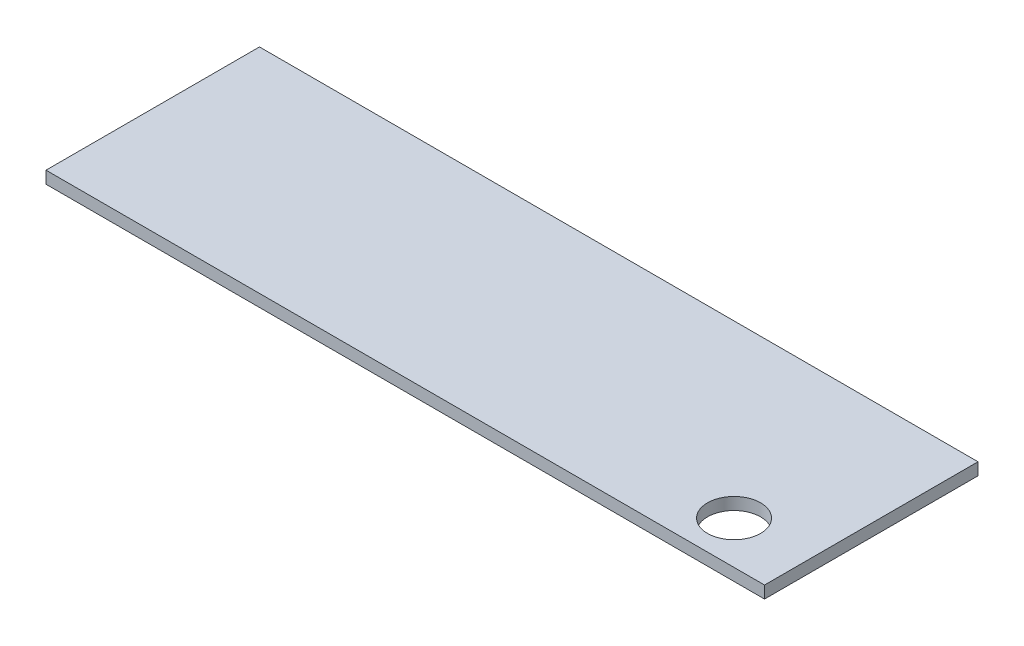
ISO-10303-21;
HEADER;
FILE_DESCRIPTION(('STEP AP214'),'2;1');
FILE_NAME('part.step','',(''),(''),'','','');
FILE_SCHEMA(('AUTOMOTIVE_DESIGN { 1 0 10303 214 1 1 1 1 }'));
ENDSEC;
DATA;
#1=APPLICATION_CONTEXT('core data for automotive mechanical design processes');
#2=APPLICATION_PROTOCOL_DEFINITION('international standard','automotive_design',2000,#1);
#3=PRODUCT_CONTEXT('',#1,'mechanical');
#4=PRODUCT('Part','Part','',(#3));
#5=PRODUCT_RELATED_PRODUCT_CATEGORY('part','',(#4));
#6=PRODUCT_DEFINITION_FORMATION('','',#4);
#7=PRODUCT_DEFINITION_CONTEXT('part definition',#1,'design');
#8=PRODUCT_DEFINITION('design','',#6,#7);
#9=PRODUCT_DEFINITION_SHAPE('','',#8);
#10=(LENGTH_UNIT() NAMED_UNIT(*) SI_UNIT(.MILLI.,.METRE.));
#11=(NAMED_UNIT(*) PLANE_ANGLE_UNIT() SI_UNIT($,.RADIAN.));
#12=(NAMED_UNIT(*) SI_UNIT($,.STERADIAN.) SOLID_ANGLE_UNIT());
#13=UNCERTAINTY_MEASURE_WITH_UNIT(LENGTH_MEASURE(1.E-05),#10,'distance_accuracy_value','');
#14=(GEOMETRIC_REPRESENTATION_CONTEXT(3) GLOBAL_UNCERTAINTY_ASSIGNED_CONTEXT((#13)) GLOBAL_UNIT_ASSIGNED_CONTEXT((#10,
#11,#12)) REPRESENTATION_CONTEXT('',''));
#15=CARTESIAN_POINT('',(0.,0.,0.));
#16=DIRECTION('',(0.,0.,1.));
#17=DIRECTION('',(1.,0.,0.));
#18=AXIS2_PLACEMENT_3D('',#15,#16,#17);
#19=CARTESIAN_POINT('',(0.,2.,0.));
#20=DIRECTION('',(0.,-1.,0.));
#21=DIRECTION('',(0.,0.,-1.));
#22=AXIS2_PLACEMENT_3D('',#19,#20,#21);
#23=PLANE('',#22);
#24=DIRECTION('',(0.,0.,1.));
#25=VECTOR('',#24,1.);
#26=CARTESIAN_POINT('',(-100.02257591524,2.,0.));
#27=LINE('',#26,#25);
#28=CARTESIAN_POINT('',(-100.02257591524,2.,-35.));
#29=VERTEX_POINT('',#28);
#30=CARTESIAN_POINT('',(-100.02257591524,2.,0.));
#31=VERTEX_POINT('',#30);
#32=EDGE_CURVE('E92',#29,#31,#27,.T.);
#33=ORIENTED_EDGE('',*,*,#32,.T.);
#34=DIRECTION('',(1.,0.,0.));
#35=VECTOR('',#34,1.);
#36=CARTESIAN_POINT('',(17.7871485943775,2.,0.));
#37=LINE('',#36,#35);
#38=CARTESIAN_POINT('',(17.7871485943775,2.,0.));
#39=VERTEX_POINT('',#38);
#40=EDGE_CURVE('E87',#31,#39,#37,.T.);
#41=ORIENTED_EDGE('',*,*,#40,.T.);
#42=DIRECTION('',(0.,0.,-1.));
#43=VECTOR('',#42,1.);
#44=CARTESIAN_POINT('',(17.7871485943775,2.,-35.));
#45=LINE('',#44,#43);
#46=CARTESIAN_POINT('',(17.7871485943775,2.,-35.));
#47=VERTEX_POINT('',#46);
#48=EDGE_CURVE('E90',#39,#47,#45,.T.);
#49=ORIENTED_EDGE('',*,*,#48,.T.);
#50=DIRECTION('',(-1.,0.,0.));
#51=VECTOR('',#50,1.);
#52=CARTESIAN_POINT('',(-100.02257591524,2.,-35.));
#53=LINE('',#52,#51);
#54=EDGE_CURVE('E57',#47,#29,#53,.T.);
#55=ORIENTED_EDGE('',*,*,#54,.T.);
#56=EDGE_LOOP('',(#33,#41,#49,#55));
#57=FACE_BOUND('',#56,.T.);
#58=CARTESIAN_POINT('',(5.78714859437752,2.,-7.));
#59=DIRECTION('',(0.,1.,0.));
#60=DIRECTION('',(0.,0.,1.));
#61=AXIS2_PLACEMENT_3D('',#58,#59,#60);
#62=CIRCLE('',#61,4.35);
#63=CARTESIAN_POINT('',(5.78714859437752,2.,-2.65));
#64=VERTEX_POINT('',#63);
#65=EDGE_CURVE('E112',#64,#64,#62,.T.);
#66=ORIENTED_EDGE('',*,*,#65,.F.);
#67=EDGE_LOOP('',(#66));
#68=FACE_BOUND('',#67,.T.);
#69=ADVANCED_FACE('F39',(#57,#68),#23,.F.);
#70=CARTESIAN_POINT('',(0.,0.,0.));
#71=DIRECTION('',(0.,-1.,0.));
#72=DIRECTION('',(0.,0.,-1.));
#73=AXIS2_PLACEMENT_3D('',#70,#71,#72);
#74=PLANE('',#73);
#75=DIRECTION('',(0.,0.,1.));
#76=VECTOR('',#75,1.);
#77=CARTESIAN_POINT('',(-100.02257591524,0.,0.));
#78=LINE('',#77,#76);
#79=CARTESIAN_POINT('',(-100.02257591524,0.,-35.));
#80=VERTEX_POINT('',#79);
#81=CARTESIAN_POINT('',(-100.02257591524,0.,0.));
#82=VERTEX_POINT('',#81);
#83=EDGE_CURVE('E108',#80,#82,#78,.T.);
#84=ORIENTED_EDGE('',*,*,#83,.F.);
#85=DIRECTION('',(-1.,0.,0.));
#86=VECTOR('',#85,1.);
#87=CARTESIAN_POINT('',(-100.02257591524,0.,-35.));
#88=LINE('',#87,#86);
#89=CARTESIAN_POINT('',(17.7871485943775,0.,-35.));
#90=VERTEX_POINT('',#89);
#91=EDGE_CURVE('E80',#90,#80,#88,.T.);
#92=ORIENTED_EDGE('',*,*,#91,.F.);
#93=DIRECTION('',(0.,0.,-1.));
#94=VECTOR('',#93,1.);
#95=CARTESIAN_POINT('',(17.7871485943775,0.,-35.));
#96=LINE('',#95,#94);
#97=CARTESIAN_POINT('',(17.7871485943775,0.,0.));
#98=VERTEX_POINT('',#97);
#99=EDGE_CURVE('E74',#98,#90,#96,.T.);
#100=ORIENTED_EDGE('',*,*,#99,.F.);
#101=DIRECTION('',(1.,0.,0.));
#102=VECTOR('',#101,1.);
#103=CARTESIAN_POINT('',(17.7871485943775,0.,0.));
#104=LINE('',#103,#102);
#105=EDGE_CURVE('E97',#82,#98,#104,.T.);
#106=ORIENTED_EDGE('',*,*,#105,.F.);
#107=EDGE_LOOP('',(#84,#92,#100,#106));
#108=FACE_BOUND('',#107,.T.);
#109=CARTESIAN_POINT('',(5.78714859437752,0.,-7.));
#110=DIRECTION('',(0.,1.,0.));
#111=DIRECTION('',(0.,0.,1.));
#112=AXIS2_PLACEMENT_3D('',#109,#110,#111);
#113=CIRCLE('',#112,4.35);
#114=CARTESIAN_POINT('',(5.78714859437752,0.,-2.65));
#115=VERTEX_POINT('',#114);
#116=EDGE_CURVE('E130',#115,#115,#113,.T.);
#117=ORIENTED_EDGE('',*,*,#116,.T.);
#118=EDGE_LOOP('',(#117));
#119=FACE_BOUND('',#118,.T.);
#120=ADVANCED_FACE('F125',(#108,#119),#74,.T.);
#121=CARTESIAN_POINT('',(-100.02257591524,2.,0.));
#122=DIRECTION('',(1.,0.,0.));
#123=DIRECTION('',(0.,0.,-1.));
#124=AXIS2_PLACEMENT_3D('',#121,#122,#123);
#125=PLANE('',#124);
#126=ORIENTED_EDGE('',*,*,#83,.T.);
#127=DIRECTION('',(0.,-1.,0.));
#128=VECTOR('',#127,1.);
#129=CARTESIAN_POINT('',(-100.02257591524,2.,0.));
#130=LINE('',#129,#128);
#131=EDGE_CURVE('E11',#31,#82,#130,.T.);
#132=ORIENTED_EDGE('',*,*,#131,.F.);
#133=ORIENTED_EDGE('',*,*,#32,.F.);
#134=DIRECTION('',(0.,-1.,0.));
#135=VECTOR('',#134,1.);
#136=CARTESIAN_POINT('',(-100.02257591524,2.,-35.));
#137=LINE('',#136,#135);
#138=EDGE_CURVE('E104',#29,#80,#137,.T.);
#139=ORIENTED_EDGE('',*,*,#138,.T.);
#140=EDGE_LOOP('',(#126,#132,#133,#139));
#141=FACE_BOUND('',#140,.T.);
#142=ADVANCED_FACE('F41',(#141),#125,.F.);
#143=CARTESIAN_POINT('',(17.7871485943775,2.,0.));
#144=DIRECTION('',(0.,0.,-1.));
#145=DIRECTION('',(-1.,0.,0.));
#146=AXIS2_PLACEMENT_3D('',#143,#144,#145);
#147=PLANE('',#146);
#148=ORIENTED_EDGE('',*,*,#105,.T.);
#149=DIRECTION('',(0.,-1.,0.));
#150=VECTOR('',#149,1.);
#151=CARTESIAN_POINT('',(17.7871485943775,2.,0.));
#152=LINE('',#151,#150);
#153=EDGE_CURVE('E49',#39,#98,#152,.T.);
#154=ORIENTED_EDGE('',*,*,#153,.F.);
#155=ORIENTED_EDGE('',*,*,#40,.F.);
#156=ORIENTED_EDGE('',*,*,#131,.T.);
#157=EDGE_LOOP('',(#148,#154,#155,#156));
#158=FACE_BOUND('',#157,.T.);
#159=ADVANCED_FACE('F96',(#158),#147,.F.);
#160=CARTESIAN_POINT('',(17.7871485943775,2.,-35.));
#161=DIRECTION('',(-1.,0.,0.));
#162=DIRECTION('',(0.,0.,1.));
#163=AXIS2_PLACEMENT_3D('',#160,#161,#162);
#164=PLANE('',#163);
#165=ORIENTED_EDGE('',*,*,#99,.T.);
#166=DIRECTION('',(0.,-1.,0.));
#167=VECTOR('',#166,1.);
#168=CARTESIAN_POINT('',(17.7871485943775,2.,-35.));
#169=LINE('',#168,#167);
#170=EDGE_CURVE('E99',#47,#90,#169,.T.);
#171=ORIENTED_EDGE('',*,*,#170,.F.);
#172=ORIENTED_EDGE('',*,*,#48,.F.);
#173=ORIENTED_EDGE('',*,*,#153,.T.);
#174=EDGE_LOOP('',(#165,#171,#172,#173));
#175=FACE_BOUND('',#174,.T.);
#176=ADVANCED_FACE('F100',(#175),#164,.F.);
#177=CARTESIAN_POINT('',(-100.02257591524,2.,-35.));
#178=DIRECTION('',(0.,0.,1.));
#179=DIRECTION('',(1.,0.,0.));
#180=AXIS2_PLACEMENT_3D('',#177,#178,#179);
#181=PLANE('',#180);
#182=ORIENTED_EDGE('',*,*,#91,.T.);
#183=ORIENTED_EDGE('',*,*,#138,.F.);
#184=ORIENTED_EDGE('',*,*,#54,.F.);
#185=ORIENTED_EDGE('',*,*,#170,.T.);
#186=EDGE_LOOP('',(#182,#183,#184,#185));
#187=FACE_BOUND('',#186,.T.);
#188=ADVANCED_FACE('F122',(#187),#181,.F.);
#189=CARTESIAN_POINT('',(5.78714859437752,2.,-7.));
#190=DIRECTION('',(0.,-1.,0.));
#191=DIRECTION('',(0.,0.,-1.));
#192=AXIS2_PLACEMENT_3D('',#189,#190,#191);
#193=CYLINDRICAL_SURFACE('',#192,4.35);
#194=ORIENTED_EDGE('',*,*,#65,.T.);
#195=EDGE_LOOP('',(#194));
#196=FACE_BOUND('',#195,.T.);
#197=ORIENTED_EDGE('',*,*,#116,.F.);
#198=EDGE_LOOP('',(#197));
#199=FACE_BOUND('',#198,.T.);
#200=ADVANCED_FACE('F138',(#196,#199),#193,.F.);
#201=CLOSED_SHELL('',(#69,#120,#142,#159,#176,#188,#200));
#202=MANIFOLD_SOLID_BREP('B2',#201);
#203=ADVANCED_BREP_SHAPE_REPRESENTATION('',(#18,#202),#14);
#204=SHAPE_DEFINITION_REPRESENTATION(#9,#203);
ENDSEC;
END-ISO-10303-21;
